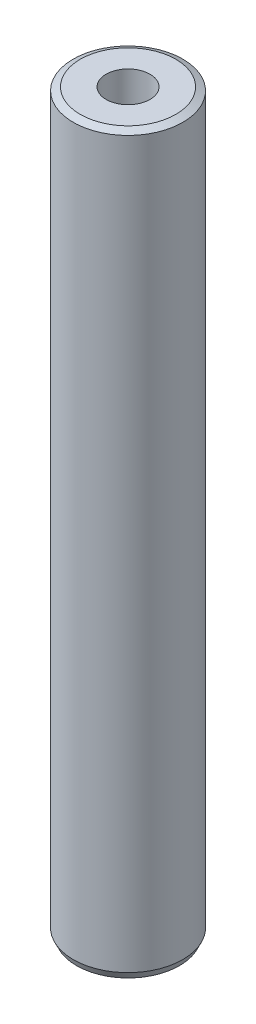
ISO-10303-21;
HEADER;
FILE_DESCRIPTION(('STEP AP214'),'2;1');
FILE_NAME('part.step','',(''),(''),'','','');
FILE_SCHEMA(('AUTOMOTIVE_DESIGN { 1 0 10303 214 1 1 1 1 }'));
ENDSEC;
DATA;
#1=APPLICATION_CONTEXT('core data for automotive mechanical design processes');
#2=APPLICATION_PROTOCOL_DEFINITION('international standard','automotive_design',2000,#1);
#3=PRODUCT_CONTEXT('',#1,'mechanical');
#4=PRODUCT('Part','Part','',(#3));
#5=PRODUCT_RELATED_PRODUCT_CATEGORY('part','',(#4));
#6=PRODUCT_DEFINITION_FORMATION('','',#4);
#7=PRODUCT_DEFINITION_CONTEXT('part definition',#1,'design');
#8=PRODUCT_DEFINITION('design','',#6,#7);
#9=PRODUCT_DEFINITION_SHAPE('','',#8);
#10=(LENGTH_UNIT() NAMED_UNIT(*) SI_UNIT(.MILLI.,.METRE.));
#11=(NAMED_UNIT(*) PLANE_ANGLE_UNIT() SI_UNIT($,.RADIAN.));
#12=(NAMED_UNIT(*) SI_UNIT($,.STERADIAN.) SOLID_ANGLE_UNIT());
#13=UNCERTAINTY_MEASURE_WITH_UNIT(LENGTH_MEASURE(1.E-05),#10,'distance_accuracy_value','');
#14=(GEOMETRIC_REPRESENTATION_CONTEXT(3) GLOBAL_UNCERTAINTY_ASSIGNED_CONTEXT((#13)) GLOBAL_UNIT_ASSIGNED_CONTEXT((#10,
#11,#12)) REPRESENTATION_CONTEXT('',''));
#15=CARTESIAN_POINT('',(0.,0.,0.));
#16=DIRECTION('',(0.,0.,1.));
#17=DIRECTION('',(1.,0.,0.));
#18=AXIS2_PLACEMENT_3D('',#15,#16,#17);
#19=CARTESIAN_POINT('',(0.,301.902290609612,0.));
#20=DIRECTION('',(0.,-1.,0.));
#21=DIRECTION('',(0.,0.,-1.));
#22=AXIS2_PLACEMENT_3D('',#19,#20,#21);
#23=CYLINDRICAL_SURFACE('',#22,22.5);
#24=CARTESIAN_POINT('',(0.,300.521236001476,0.));
#25=DIRECTION('',(0.,1.,0.));
#26=DIRECTION('',(0.,0.,1.));
#27=AXIS2_PLACEMENT_3D('',#24,#25,#26);
#28=CIRCLE('',#27,22.5);
#29=CARTESIAN_POINT('',(0.,300.521236001476,-22.5));
#30=VERTEX_POINT('',#29);
#31=EDGE_CURVE('E50',#30,#30,#28,.F.);
#32=CARTESIAN_POINT('',(0.,2.88464936791366,0.));
#33=DIRECTION('',(0.,1.,0.));
#34=DIRECTION('',(0.,0.,1.));
#35=AXIS2_PLACEMENT_3D('',#32,#33,#34);
#36=CIRCLE('',#35,22.5);
#37=CARTESIAN_POINT('',(0.,2.88464936791366,-22.5));
#38=VERTEX_POINT('',#37);
#39=EDGE_CURVE('E51',#38,#38,#36,.T.);
#40=CARTESIAN_POINT('',(0.,300.521236001476,-22.5));
#41=CARTESIAN_POINT('',(0.,297.42085489071,-22.5));
#42=CARTESIAN_POINT('',(0.,294.320473779944,-22.5));
#43=CARTESIAN_POINT('',(0.,288.119711558411,-22.5));
#44=CARTESIAN_POINT('',(0.,285.019330447645,-22.5));
#45=CARTESIAN_POINT('',(0.,278.818568226112,-22.5));
#46=CARTESIAN_POINT('',(0.,275.718187115346,-22.5));
#47=CARTESIAN_POINT('',(0.,269.517424893813,-22.5));
#48=CARTESIAN_POINT('',(0.,266.417043783047,-22.5));
#49=CARTESIAN_POINT('',(0.,260.216281561515,-22.5));
#50=CARTESIAN_POINT('',(0.,257.115900450748,-22.5));
#51=CARTESIAN_POINT('',(0.,250.915138229216,-22.5));
#52=CARTESIAN_POINT('',(0.,247.814757118449,-22.5));
#53=CARTESIAN_POINT('',(0.,241.613994896917,-22.5));
#54=CARTESIAN_POINT('',(0.,238.513613786151,-22.5));
#55=CARTESIAN_POINT('',(0.,232.312851564618,-22.5));
#56=CARTESIAN_POINT('',(0.,229.212470453852,-22.5));
#57=CARTESIAN_POINT('',(0.,223.011708232319,-22.5));
#58=CARTESIAN_POINT('',(0.,219.911327121553,-22.5));
#59=CARTESIAN_POINT('',(0.,213.71056490002,-22.5));
#60=CARTESIAN_POINT('',(0.,210.610183789254,-22.5));
#61=CARTESIAN_POINT('',(0.,204.409421567722,-22.5));
#62=CARTESIAN_POINT('',(0.,201.309040456955,-22.5));
#63=CARTESIAN_POINT('',(0.,195.108278235423,-22.5));
#64=CARTESIAN_POINT('',(0.,192.007897124656,-22.5));
#65=CARTESIAN_POINT('',(0.,185.807134903124,-22.5));
#66=CARTESIAN_POINT('',(0.,182.706753792358,-22.5));
#67=CARTESIAN_POINT('',(0.,176.505991570825,-22.5));
#68=CARTESIAN_POINT('',(0.,173.405610460059,-22.5));
#69=CARTESIAN_POINT('',(0.,167.204848238526,-22.5));
#70=CARTESIAN_POINT('',(0.,164.10446712776,-22.5));
#71=CARTESIAN_POINT('',(0.,157.903704906227,-22.5));
#72=CARTESIAN_POINT('',(0.,154.803323795461,-22.5));
#73=CARTESIAN_POINT('',(0.,148.602561573929,-22.5));
#74=CARTESIAN_POINT('',(0.,145.502180463162,-22.5));
#75=CARTESIAN_POINT('',(0.,139.30141824163,-22.5));
#76=CARTESIAN_POINT('',(0.,136.201037130864,-22.5));
#77=CARTESIAN_POINT('',(0.,130.000274909331,-22.5));
#78=CARTESIAN_POINT('',(0.,126.899893798565,-22.5));
#79=CARTESIAN_POINT('',(0.,120.699131577032,-22.5));
#80=CARTESIAN_POINT('',(0.,117.598750466266,-22.5));
#81=CARTESIAN_POINT('',(0.,111.397988244733,-22.5));
#82=CARTESIAN_POINT('',(0.,108.297607133967,-22.5));
#83=CARTESIAN_POINT('',(0.,102.096844912434,-22.5));
#84=CARTESIAN_POINT('',(0.,98.9964638016682,-22.5));
#85=CARTESIAN_POINT('',(0.,92.7957015801357,-22.5));
#86=CARTESIAN_POINT('',(0.,89.6953204693694,-22.5));
#87=CARTESIAN_POINT('',(0.,83.4945582478368,-22.5));
#88=CARTESIAN_POINT('',(0.,80.3941771370706,-22.5));
#89=CARTESIAN_POINT('',(0.,74.193414915538,-22.5));
#90=CARTESIAN_POINT('',(0.,71.0930338047717,-22.5));
#91=CARTESIAN_POINT('',(0.,64.8922715832392,-22.5));
#92=CARTESIAN_POINT('',(0.,61.7918904724729,-22.5));
#93=CARTESIAN_POINT('',(0.,55.5911282509404,-22.5));
#94=CARTESIAN_POINT('',(0.,52.4907471401741,-22.5));
#95=CARTESIAN_POINT('',(0.,46.2899849186415,-22.5));
#96=CARTESIAN_POINT('',(0.,43.1896038078753,-22.5));
#97=CARTESIAN_POINT('',(0.,36.9888415863427,-22.5));
#98=CARTESIAN_POINT('',(0.,33.8884604755764,-22.5));
#99=CARTESIAN_POINT('',(0.,27.6876982540439,-22.5));
#100=CARTESIAN_POINT('',(0.,24.5873171432776,-22.5));
#101=CARTESIAN_POINT('',(0.,18.3865549217451,-22.5));
#102=CARTESIAN_POINT('',(0.,15.2861738109788,-22.5));
#103=CARTESIAN_POINT('',(0.,9.0854115894462,-22.5));
#104=CARTESIAN_POINT('',(0.,5.98503047867993,-22.5));
#105=CARTESIAN_POINT('',(0.,2.88464936791366,-22.5));
#106=B_SPLINE_CURVE_WITH_KNOTS('',3,(#40,#41,#42,#43,#44,#45,#46,#47,#48,#49,#50,#51,#52,#53,
#54,#55,#56,#57,#58,#59,#60,#61,#62,#63,#64,#65,#66,#67,#68,#69,#70,#71,#72,#73,#74,#75,#76,#77,
#78,#79,#80,#81,#82,#83,#84,#85,#86,#87,#88,#89,#90,#91,#92,#93,#94,#95,#96,#97,#98,#99,#100,
#101,#102,#103,#104,#105),.UNSPECIFIED.,.F.,.F.,(4,2,2,2,2,2,2,2,2,2,2,2,2,2,2,2,2,2,2,2,2,2,2,
2,2,2,2,2,2,2,2,2,4),(0.,9.30114333229881,18.6022866645976,27.9034299968964,37.2045733291953,
46.5057166614941,55.8068599937929,65.1080033260918,74.4091466583906,83.7102899906894,
93.0114333229882,102.312576655287,111.613719987586,120.914863319885,130.216006652184,
139.517149984482,148.818293316781,158.11943664908,167.420579981379,176.721723313678,
186.022866645977,195.324009978275,204.625153310574,213.926296642873,223.227439975172,
232.528583307471,241.829726639769,251.130869972068,260.432013304367,269.733156636666,
279.034299968965,288.335443301264,297.636586633562),.UNSPECIFIED.);
#107=EDGE_CURVE('BSEAM39',#30,#38,#106,.T.);
#108=ORIENTED_EDGE('',*,*,#31,.T.);
#109=ORIENTED_EDGE('',*,*,#39,.T.);
#110=ORIENTED_EDGE('',*,*,#107,.T.);
#111=ORIENTED_EDGE('',*,*,#107,.F.);
#112=EDGE_LOOP('',(#108,#110,#109,#111));
#113=FACE_BOUND('',#112,.T.);
#114=ADVANCED_FACE('F39',(#113),#23,.T.);
#115=CARTESIAN_POINT('',(0.,301.902290609612,0.));
#116=DIRECTION('',(0.,1.,0.));
#117=DIRECTION('',(0.,0.,1.));
#118=AXIS2_PLACEMENT_3D('',#115,#116,#117);
#119=PLANE('',#118);
#120=CARTESIAN_POINT('',(0.,301.902290609612,0.));
#121=DIRECTION('',(0.,1.,0.));
#122=DIRECTION('',(0.,0.,1.));
#123=AXIS2_PLACEMENT_3D('',#120,#121,#122);
#124=CIRCLE('',#123,19.6153506320876);
#125=CARTESIAN_POINT('',(0.,301.902290609612,19.6153506320876));
#126=VERTEX_POINT('',#125);
#127=EDGE_CURVE('E54',#126,#126,#124,.T.);
#128=ORIENTED_EDGE('',*,*,#127,.T.);
#129=EDGE_LOOP('',(#128));
#130=FACE_BOUND('',#129,.T.);
#131=CARTESIAN_POINT('',(0.,301.902290609612,0.));
#132=DIRECTION('',(0.,1.,0.));
#133=DIRECTION('',(0.,0.,1.));
#134=AXIS2_PLACEMENT_3D('',#131,#132,#133);
#135=CIRCLE('',#134,9.00401112460708);
#136=CARTESIAN_POINT('',(0.,301.902290609612,-9.00401112460708));
#137=VERTEX_POINT('',#136);
#138=EDGE_CURVE('E58',#137,#137,#135,.T.);
#139=ORIENTED_EDGE('',*,*,#138,.F.);
#140=EDGE_LOOP('',(#139));
#141=FACE_BOUND('',#140,.T.);
#142=ADVANCED_FACE('F69',(#130,#141),#119,.T.);
#143=CARTESIAN_POINT('',(0.,0.,0.));
#144=DIRECTION('',(0.,1.,0.));
#145=DIRECTION('',(0.,0.,1.));
#146=AXIS2_PLACEMENT_3D('',#143,#144,#145);
#147=PLANE('',#146);
#148=CARTESIAN_POINT('',(0.,0.,0.));
#149=DIRECTION('',(0.,1.,0.));
#150=DIRECTION('',(0.,0.,1.));
#151=AXIS2_PLACEMENT_3D('',#148,#149,#150);
#152=CIRCLE('',#151,21.1189453918635);
#153=CARTESIAN_POINT('',(0.,0.,21.1189453918635));
#154=VERTEX_POINT('',#153);
#155=EDGE_CURVE('E10',#154,#154,#152,.F.);
#156=ORIENTED_EDGE('',*,*,#155,.T.);
#157=EDGE_LOOP('',(#156));
#158=FACE_BOUND('',#157,.T.);
#159=CARTESIAN_POINT('',(0.,0.,0.));
#160=DIRECTION('',(0.,1.,0.));
#161=DIRECTION('',(0.,0.,1.));
#162=AXIS2_PLACEMENT_3D('',#159,#160,#161);
#163=CIRCLE('',#162,9.00401112460708);
#164=CARTESIAN_POINT('',(0.,0.,-9.00401112460708));
#165=VERTEX_POINT('',#164);
#166=EDGE_CURVE('E63',#165,#165,#163,.T.);
#167=ORIENTED_EDGE('',*,*,#166,.T.);
#168=EDGE_LOOP('',(#167));
#169=FACE_BOUND('',#168,.T.);
#170=ADVANCED_FACE('F75',(#158,#169),#147,.F.);
#171=CARTESIAN_POINT('',(0.,301.902290609612,0.));
#172=DIRECTION('',(0.,-1.,0.));
#173=DIRECTION('',(0.,0.,-1.));
#174=AXIS2_PLACEMENT_3D('',#171,#172,#173);
#175=CYLINDRICAL_SURFACE('',#174,9.00401112460708);
#176=CARTESIAN_POINT('',(0.,301.902290609612,-9.00401112460708));
#177=CARTESIAN_POINT('',(0.,298.757475082429,-9.00401112460708));
#178=CARTESIAN_POINT('',(0.,295.612659555245,-9.00401112460708));
#179=CARTESIAN_POINT('',(0.,289.323028500878,-9.00401112460708));
#180=CARTESIAN_POINT('',(0.,286.178212973695,-9.00401112460708));
#181=CARTESIAN_POINT('',(0.,279.888581919328,-9.00401112460708));
#182=CARTESIAN_POINT('',(0.,276.743766392144,-9.00401112460708));
#183=CARTESIAN_POINT('',(0.,270.454135337777,-9.00401112460708));
#184=CARTESIAN_POINT('',(0.,267.309319810594,-9.00401112460708));
#185=CARTESIAN_POINT('',(0.,261.019688756227,-9.00401112460708));
#186=CARTESIAN_POINT('',(0.,257.874873229044,-9.00401112460708));
#187=CARTESIAN_POINT('',(0.,251.585242174677,-9.00401112460708));
#188=CARTESIAN_POINT('',(0.,248.440426647493,-9.00401112460708));
#189=CARTESIAN_POINT('',(0.,242.150795593126,-9.00401112460708));
#190=CARTESIAN_POINT('',(0.,239.005980065943,-9.00401112460708));
#191=CARTESIAN_POINT('',(0.,232.716349011576,-9.00401112460708));
#192=CARTESIAN_POINT('',(0.,229.571533484393,-9.00401112460708));
#193=CARTESIAN_POINT('',(0.,223.281902430026,-9.00401112460708));
#194=CARTESIAN_POINT('',(0.,220.137086902842,-9.00401112460708));
#195=CARTESIAN_POINT('',(0.,213.847455848475,-9.00401112460708));
#196=CARTESIAN_POINT('',(0.,210.702640321292,-9.00401112460708));
#197=CARTESIAN_POINT('',(0.,204.413009266925,-9.00401112460708));
#198=CARTESIAN_POINT('',(0.,201.268193739741,-9.00401112460708));
#199=CARTESIAN_POINT('',(0.,194.978562685374,-9.00401112460708));
#200=CARTESIAN_POINT('',(0.,191.833747158191,-9.00401112460708));
#201=CARTESIAN_POINT('',(0.,185.544116103824,-9.00401112460708));
#202=CARTESIAN_POINT('',(0.,182.399300576641,-9.00401112460708));
#203=CARTESIAN_POINT('',(0.,176.109669522274,-9.00401112460708));
#204=CARTESIAN_POINT('',(0.,172.96485399509,-9.00401112460708));
#205=CARTESIAN_POINT('',(0.,166.675222940723,-9.00401112460708));
#206=CARTESIAN_POINT('',(0.,163.53040741354,-9.00401112460708));
#207=CARTESIAN_POINT('',(0.,157.240776359173,-9.00401112460708));
#208=CARTESIAN_POINT('',(0.,154.09596083199,-9.00401112460708));
#209=CARTESIAN_POINT('',(0.,147.806329777623,-9.00401112460708));
#210=CARTESIAN_POINT('',(0.,144.661514250439,-9.00401112460708));
#211=CARTESIAN_POINT('',(0.,138.371883196072,-9.00401112460708));
#212=CARTESIAN_POINT('',(0.,135.227067668889,-9.00401112460708));
#213=CARTESIAN_POINT('',(0.,128.937436614522,-9.00401112460708));
#214=CARTESIAN_POINT('',(0.,125.792621087338,-9.00401112460708));
#215=CARTESIAN_POINT('',(0.,119.502990032971,-9.00401112460708));
#216=CARTESIAN_POINT('',(0.,116.358174505788,-9.00401112460708));
#217=CARTESIAN_POINT('',(0.,110.068543451421,-9.00401112460708));
#218=CARTESIAN_POINT('',(0.,106.923727924238,-9.00401112460708));
#219=CARTESIAN_POINT('',(0.,100.634096869871,-9.00401112460708));
#220=CARTESIAN_POINT('',(0.,97.4892813426872,-9.00401112460708));
#221=CARTESIAN_POINT('',(0.,91.1996502883203,-9.00401112460708));
#222=CARTESIAN_POINT('',(0.,88.0548347611369,-9.00401112460708));
#223=CARTESIAN_POINT('',(0.,81.7652037067699,-9.00401112460708));
#224=CARTESIAN_POINT('',(0.,78.6203881795865,-9.00401112460708));
#225=CARTESIAN_POINT('',(0.,72.3307571252195,-9.00401112460708));
#226=CARTESIAN_POINT('',(0.,69.1859415980361,-9.00401112460708));
#227=CARTESIAN_POINT('',(0.,62.8963105436692,-9.00401112460708));
#228=CARTESIAN_POINT('',(0.,59.7514950164857,-9.00401112460708));
#229=CARTESIAN_POINT('',(0.,53.4618639621188,-9.00401112460708));
#230=CARTESIAN_POINT('',(0.,50.3170484349354,-9.00401112460708));
#231=CARTESIAN_POINT('',(0.,44.0274173805684,-9.00401112460708));
#232=CARTESIAN_POINT('',(0.,40.882601853385,-9.00401112460708));
#233=CARTESIAN_POINT('',(0.,34.5929707990181,-9.00401112460708));
#234=CARTESIAN_POINT('',(0.,31.4481552718346,-9.00401112460708));
#235=CARTESIAN_POINT('',(0.,25.1585242174677,-9.00401112460708));
#236=CARTESIAN_POINT('',(0.,22.0137086902842,-9.00401112460708));
#237=CARTESIAN_POINT('',(0.,15.7240776359173,-9.00401112460708));
#238=CARTESIAN_POINT('',(0.,12.5792621087339,-9.00401112460708));
#239=CARTESIAN_POINT('',(0.,6.28963105436693,-9.00401112460708));
#240=CARTESIAN_POINT('',(0.,3.14481552718346,-9.00401112460708));
#241=CARTESIAN_POINT('',(0.,0.,-9.00401112460708));
#242=B_SPLINE_CURVE_WITH_KNOTS('',3,(#176,#177,#178,#179,#180,#181,#182,#183,#184,#185,#186,
#187,#188,#189,#190,#191,#192,#193,#194,#195,#196,#197,#198,#199,#200,#201,#202,#203,#204,#205,
#206,#207,#208,#209,#210,#211,#212,#213,#214,#215,#216,#217,#218,#219,#220,#221,#222,#223,#224,
#225,#226,#227,#228,#229,#230,#231,#232,#233,#234,#235,#236,#237,#238,#239,#240,#241),
.UNSPECIFIED.,.F.,.F.,(4,2,2,2,2,2,2,2,2,2,2,2,2,2,2,2,2,2,2,2,2,2,2,2,2,2,2,2,2,2,2,2,4),(0.,
9.43444658155035,18.8688931631007,28.3033397446511,37.7377863262015,47.1722329077519,
56.6066794893022,66.0411260708526,75.475572652403,84.9100192339534,94.3444658155037,
103.778912397054,113.213358978605,122.647805560155,132.082252141705,141.516698723256,
150.951145304806,160.385591886356,169.820038467907,179.254485049457,188.688931631008,
198.123378212558,207.557824794108,216.992271375659,226.426717957209,235.861164538759,
245.29561112031,254.73005770186,264.164504283411,273.598950864961,283.033397446511,
292.467844028062,301.902290609612),.UNSPECIFIED.);
#243=EDGE_CURVE('BSEAM70',#137,#165,#242,.T.);
#244=ORIENTED_EDGE('',*,*,#138,.T.);
#245=ORIENTED_EDGE('',*,*,#166,.F.);
#246=ORIENTED_EDGE('',*,*,#243,.T.);
#247=ORIENTED_EDGE('',*,*,#243,.F.);
#248=EDGE_LOOP('',(#244,#246,#245,#247));
#249=FACE_BOUND('',#248,.T.);
#250=ADVANCED_FACE('F70',(#249),#175,.F.);
#251=CARTESIAN_POINT('',(0.,301.902290609612,0.));
#252=DIRECTION('',(0.,-1.,0.));
#253=DIRECTION('',(0.,0.,-1.));
#254=AXIS2_PLACEMENT_3D('',#251,#252,#253);
#255=CONICAL_SURFACE('',#254,19.6153506320876,1.12428467614998);
#256=ORIENTED_EDGE('',*,*,#31,.F.);
#257=EDGE_LOOP('',(#256));
#258=FACE_BOUND('',#257,.T.);
#259=ORIENTED_EDGE('',*,*,#127,.F.);
#260=EDGE_LOOP('',(#259));
#261=FACE_BOUND('',#260,.T.);
#262=ADVANCED_FACE('F81',(#258,#261),#255,.T.);
#263=CARTESIAN_POINT('',(0.,2.88464936791361,0.));
#264=DIRECTION('',(0.,1.,0.));
#265=DIRECTION('',(0.,0.,1.));
#266=AXIS2_PLACEMENT_3D('',#263,#264,#265);
#267=CONICAL_SURFACE('',#266,22.5,0.446511650644912);
#268=ORIENTED_EDGE('',*,*,#155,.F.);
#269=EDGE_LOOP('',(#268));
#270=FACE_BOUND('',#269,.T.);
#271=ORIENTED_EDGE('',*,*,#39,.F.);
#272=EDGE_LOOP('',(#271));
#273=FACE_BOUND('',#272,.T.);
#274=ADVANCED_FACE('F45',(#270,#273),#267,.T.);
#275=CLOSED_SHELL('',(#114,#142,#170,#250,#262,#274));
#276=MANIFOLD_SOLID_BREP('B2',#275);
#277=ADVANCED_BREP_SHAPE_REPRESENTATION('',(#18,#276),#14);
#278=SHAPE_DEFINITION_REPRESENTATION(#9,#277);
ENDSEC;
END-ISO-10303-21;
